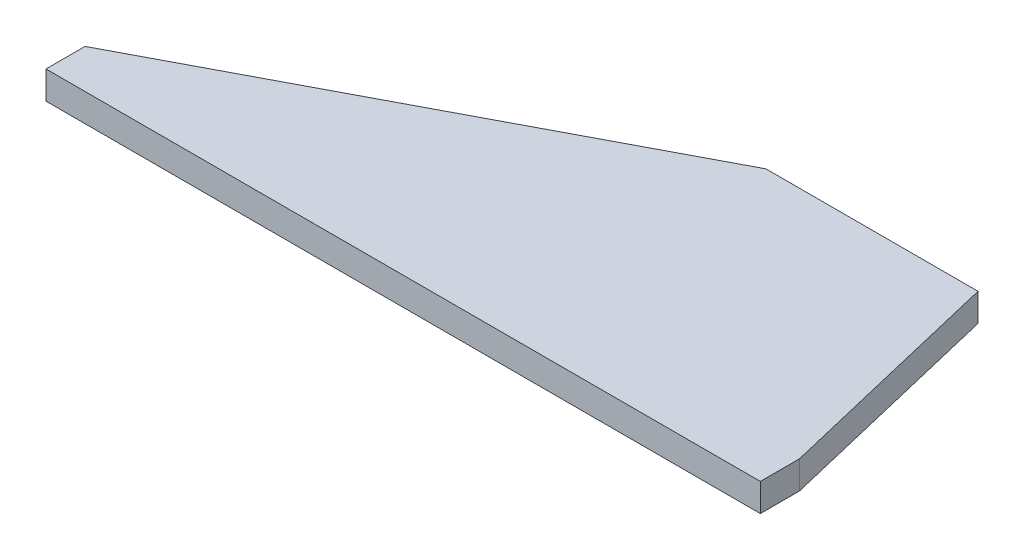
ISO-10303-21;
HEADER;
FILE_DESCRIPTION(('STEP AP214'),'2;1');
FILE_NAME('part.step','',(''),(''),'','','');
FILE_SCHEMA(('AUTOMOTIVE_DESIGN { 1 0 10303 214 1 1 1 1 }'));
ENDSEC;
DATA;
#1=APPLICATION_CONTEXT('core data for automotive mechanical design processes');
#2=APPLICATION_PROTOCOL_DEFINITION('international standard','automotive_design',2000,#1);
#3=PRODUCT_CONTEXT('',#1,'mechanical');
#4=PRODUCT('Part','Part','',(#3));
#5=PRODUCT_RELATED_PRODUCT_CATEGORY('part','',(#4));
#6=PRODUCT_DEFINITION_FORMATION('','',#4);
#7=PRODUCT_DEFINITION_CONTEXT('part definition',#1,'design');
#8=PRODUCT_DEFINITION('design','',#6,#7);
#9=PRODUCT_DEFINITION_SHAPE('','',#8);
#10=(LENGTH_UNIT() NAMED_UNIT(*) SI_UNIT(.MILLI.,.METRE.));
#11=(NAMED_UNIT(*) PLANE_ANGLE_UNIT() SI_UNIT($,.RADIAN.));
#12=(NAMED_UNIT(*) SI_UNIT($,.STERADIAN.) SOLID_ANGLE_UNIT());
#13=UNCERTAINTY_MEASURE_WITH_UNIT(LENGTH_MEASURE(1.E-05),#10,'distance_accuracy_value','');
#14=(GEOMETRIC_REPRESENTATION_CONTEXT(3) GLOBAL_UNCERTAINTY_ASSIGNED_CONTEXT((#13)) GLOBAL_UNIT_ASSIGNED_CONTEXT((#10,
#11,#12)) REPRESENTATION_CONTEXT('',''));
#15=CARTESIAN_POINT('',(0.,0.,0.));
#16=DIRECTION('',(0.,0.,1.));
#17=DIRECTION('',(1.,0.,0.));
#18=AXIS2_PLACEMENT_3D('',#15,#16,#17);
#19=CARTESIAN_POINT('',(0.,6.35,8.89));
#20=DIRECTION('',(1.,0.,0.));
#21=DIRECTION('',(0.,0.,-1.));
#22=AXIS2_PLACEMENT_3D('',#19,#20,#21);
#23=PLANE('',#22);
#24=DIRECTION('',(0.,0.,1.));
#25=VECTOR('',#24,1.);
#26=CARTESIAN_POINT('',(0.,0.,8.89));
#27=LINE('',#26,#25);
#28=CARTESIAN_POINT('',(0.,0.,0.));
#29=VERTEX_POINT('',#28);
#30=CARTESIAN_POINT('',(0.,0.,8.89));
#31=VERTEX_POINT('',#30);
#32=EDGE_CURVE('E123',#29,#31,#27,.T.);
#33=ORIENTED_EDGE('',*,*,#32,.T.);
#34=DIRECTION('',(0.,-1.,0.));
#35=VECTOR('',#34,1.);
#36=CARTESIAN_POINT('',(0.,6.35,8.89));
#37=LINE('',#36,#35);
#38=CARTESIAN_POINT('',(0.,6.35,8.89));
#39=VERTEX_POINT('',#38);
#40=EDGE_CURVE('E11',#39,#31,#37,.T.);
#41=ORIENTED_EDGE('',*,*,#40,.F.);
#42=DIRECTION('',(0.,0.,1.));
#43=VECTOR('',#42,1.);
#44=CARTESIAN_POINT('',(0.,6.35,8.89));
#45=LINE('',#44,#43);
#46=CARTESIAN_POINT('',(0.,6.35,0.));
#47=VERTEX_POINT('',#46);
#48=EDGE_CURVE('E133',#47,#39,#45,.T.);
#49=ORIENTED_EDGE('',*,*,#48,.F.);
#50=DIRECTION('',(0.,-1.,0.));
#51=VECTOR('',#50,1.);
#52=CARTESIAN_POINT('',(0.,6.35,0.));
#53=LINE('',#52,#51);
#54=EDGE_CURVE('E119',#47,#29,#53,.T.);
#55=ORIENTED_EDGE('',*,*,#54,.T.);
#56=EDGE_LOOP('',(#33,#41,#49,#55));
#57=FACE_BOUND('',#56,.T.);
#58=ADVANCED_FACE('F39',(#57),#23,.F.);
#59=CARTESIAN_POINT('',(0.,6.35,8.89));
#60=DIRECTION('',(0.,0.,-1.));
#61=DIRECTION('',(-1.,0.,0.));
#62=AXIS2_PLACEMENT_3D('',#59,#60,#61);
#63=PLANE('',#62);
#64=DIRECTION('',(1.,0.,0.));
#65=VECTOR('',#64,1.);
#66=CARTESIAN_POINT('',(0.,0.,8.89));
#67=LINE('',#66,#65);
#68=CARTESIAN_POINT('',(162.56,0.,8.89));
#69=VERTEX_POINT('',#68);
#70=EDGE_CURVE('E126',#31,#69,#67,.T.);
#71=ORIENTED_EDGE('',*,*,#70,.T.);
#72=DIRECTION('',(0.,-1.,0.));
#73=VECTOR('',#72,1.);
#74=CARTESIAN_POINT('',(162.56,6.35,8.89));
#75=LINE('',#74,#73);
#76=CARTESIAN_POINT('',(162.56,6.35,8.89));
#77=VERTEX_POINT('',#76);
#78=EDGE_CURVE('E47',#77,#69,#75,.T.);
#79=ORIENTED_EDGE('',*,*,#78,.F.);
#80=DIRECTION('',(1.,0.,0.));
#81=VECTOR('',#80,1.);
#82=CARTESIAN_POINT('',(0.,6.35,8.89));
#83=LINE('',#82,#81);
#84=EDGE_CURVE('E92',#39,#77,#83,.T.);
#85=ORIENTED_EDGE('',*,*,#84,.F.);
#86=ORIENTED_EDGE('',*,*,#40,.T.);
#87=EDGE_LOOP('',(#71,#79,#85,#86));
#88=FACE_BOUND('',#87,.T.);
#89=ADVANCED_FACE('F157',(#88),#63,.F.);
#90=CARTESIAN_POINT('',(162.56,6.35,8.89));
#91=DIRECTION('',(-1.,0.,0.));
#92=DIRECTION('',(0.,0.,1.));
#93=AXIS2_PLACEMENT_3D('',#90,#91,#92);
#94=PLANE('',#93);
#95=DIRECTION('',(0.,0.,-1.));
#96=VECTOR('',#95,1.);
#97=CARTESIAN_POINT('',(162.56,0.,8.89));
#98=LINE('',#97,#96);
#99=CARTESIAN_POINT('',(162.56,0.,0.));
#100=VERTEX_POINT('',#99);
#101=EDGE_CURVE('E128',#69,#100,#98,.T.);
#102=ORIENTED_EDGE('',*,*,#101,.T.);
#103=DIRECTION('',(0.,-1.,0.));
#104=VECTOR('',#103,1.);
#105=CARTESIAN_POINT('',(162.56,6.35,0.));
#106=LINE('',#105,#104);
#107=CARTESIAN_POINT('',(162.56,6.35,0.));
#108=VERTEX_POINT('',#107);
#109=EDGE_CURVE('E114',#108,#100,#106,.T.);
#110=ORIENTED_EDGE('',*,*,#109,.F.);
#111=DIRECTION('',(0.,0.,-1.));
#112=VECTOR('',#111,1.);
#113=CARTESIAN_POINT('',(162.56,6.35,8.89));
#114=LINE('',#113,#112);
#115=EDGE_CURVE('E105',#77,#108,#114,.T.);
#116=ORIENTED_EDGE('',*,*,#115,.F.);
#117=ORIENTED_EDGE('',*,*,#78,.T.);
#118=EDGE_LOOP('',(#102,#110,#116,#117));
#119=FACE_BOUND('',#118,.T.);
#120=ADVANCED_FACE('F139',(#119),#94,.F.);
#121=CARTESIAN_POINT('',(149.86,6.35,-53.34));
#122=DIRECTION('',(-0.972806214685367,0.,0.23162052730604));
#123=DIRECTION('',(0.23162052730604,0.,0.972806214685367));
#124=AXIS2_PLACEMENT_3D('',#121,#122,#123);
#125=PLANE('',#124);
#126=DIRECTION('',(-0.23162052730604,0.,-0.972806214685367));
#127=VECTOR('',#126,1.);
#128=CARTESIAN_POINT('',(149.86,0.,-53.34));
#129=LINE('',#128,#127);
#130=CARTESIAN_POINT('',(149.86,0.,-53.34));
#131=VERTEX_POINT('',#130);
#132=EDGE_CURVE('E113',#100,#131,#129,.T.);
#133=ORIENTED_EDGE('',*,*,#132,.T.);
#134=DIRECTION('',(0.,-1.,0.));
#135=VECTOR('',#134,1.);
#136=CARTESIAN_POINT('',(149.86,6.35,-53.34));
#137=LINE('',#136,#135);
#138=CARTESIAN_POINT('',(149.86,6.35,-53.34));
#139=VERTEX_POINT('',#138);
#140=EDGE_CURVE('E110',#139,#131,#137,.T.);
#141=ORIENTED_EDGE('',*,*,#140,.F.);
#142=DIRECTION('',(-0.23162052730604,0.,-0.972806214685367));
#143=VECTOR('',#142,1.);
#144=CARTESIAN_POINT('',(149.86,6.35,-53.34));
#145=LINE('',#144,#143);
#146=EDGE_CURVE('E99',#108,#139,#145,.T.);
#147=ORIENTED_EDGE('',*,*,#146,.F.);
#148=ORIENTED_EDGE('',*,*,#109,.T.);
#149=EDGE_LOOP('',(#133,#141,#147,#148));
#150=FACE_BOUND('',#149,.T.);
#151=ADVANCED_FACE('F111',(#150),#125,.F.);
#152=CARTESIAN_POINT('',(101.6,6.35,-53.34));
#153=DIRECTION('',(0.,0.,1.));
#154=DIRECTION('',(1.,0.,0.));
#155=AXIS2_PLACEMENT_3D('',#152,#153,#154);
#156=PLANE('',#155);
#157=DIRECTION('',(-1.,0.,0.));
#158=VECTOR('',#157,1.);
#159=CARTESIAN_POINT('',(101.6,0.,-53.34));
#160=LINE('',#159,#158);
#161=CARTESIAN_POINT('',(101.6,0.,-53.34));
#162=VERTEX_POINT('',#161);
#163=EDGE_CURVE('E78',#131,#162,#160,.T.);
#164=ORIENTED_EDGE('',*,*,#163,.T.);
#165=DIRECTION('',(0.,-1.,0.));
#166=VECTOR('',#165,1.);
#167=CARTESIAN_POINT('',(101.6,6.35,-53.34));
#168=LINE('',#167,#166);
#169=CARTESIAN_POINT('',(101.6,6.35,-53.34));
#170=VERTEX_POINT('',#169);
#171=EDGE_CURVE('E115',#170,#162,#168,.T.);
#172=ORIENTED_EDGE('',*,*,#171,.F.);
#173=DIRECTION('',(-1.,0.,0.));
#174=VECTOR('',#173,1.);
#175=CARTESIAN_POINT('',(101.6,6.35,-53.34));
#176=LINE('',#175,#174);
#177=EDGE_CURVE('E103',#139,#170,#176,.T.);
#178=ORIENTED_EDGE('',*,*,#177,.F.);
#179=ORIENTED_EDGE('',*,*,#140,.T.);
#180=EDGE_LOOP('',(#164,#172,#178,#179));
#181=FACE_BOUND('',#180,.T.);
#182=ADVANCED_FACE('F117',(#181),#156,.F.);
#183=CARTESIAN_POINT('',(0.,6.35,0.));
#184=DIRECTION('',(0.46483389898992,0.,0.885397902837944));
#185=DIRECTION('',(0.885397902837944,0.,-0.46483389898992));
#186=AXIS2_PLACEMENT_3D('',#183,#184,#185);
#187=PLANE('',#186);
#188=DIRECTION('',(-0.885397902837944,0.,0.46483389898992));
#189=VECTOR('',#188,1.);
#190=CARTESIAN_POINT('',(0.,0.,0.));
#191=LINE('',#190,#189);
#192=EDGE_CURVE('E84',#162,#29,#191,.T.);
#193=ORIENTED_EDGE('',*,*,#192,.T.);
#194=ORIENTED_EDGE('',*,*,#54,.F.);
#195=DIRECTION('',(-0.885397902837944,0.,0.46483389898992));
#196=VECTOR('',#195,1.);
#197=CARTESIAN_POINT('',(0.,6.35,0.));
#198=LINE('',#197,#196);
#199=EDGE_CURVE('E55',#170,#47,#198,.T.);
#200=ORIENTED_EDGE('',*,*,#199,.F.);
#201=ORIENTED_EDGE('',*,*,#171,.T.);
#202=EDGE_LOOP('',(#193,#194,#200,#201));
#203=FACE_BOUND('',#202,.T.);
#204=ADVANCED_FACE('F146',(#203),#187,.F.);
#205=CARTESIAN_POINT('',(0.,6.35,0.));
#206=DIRECTION('',(0.,-1.,0.));
#207=DIRECTION('',(0.,0.,-1.));
#208=AXIS2_PLACEMENT_3D('',#205,#206,#207);
#209=PLANE('',#208);
#210=ORIENTED_EDGE('',*,*,#48,.T.);
#211=ORIENTED_EDGE('',*,*,#84,.T.);
#212=ORIENTED_EDGE('',*,*,#115,.T.);
#213=ORIENTED_EDGE('',*,*,#146,.T.);
#214=ORIENTED_EDGE('',*,*,#177,.T.);
#215=ORIENTED_EDGE('',*,*,#199,.T.);
#216=EDGE_LOOP('',(#210,#211,#212,#213,#214,#215));
#217=FACE_BOUND('',#216,.T.);
#218=ADVANCED_FACE('F101',(#217),#209,.F.);
#219=CARTESIAN_POINT('',(0.,0.,0.));
#220=DIRECTION('',(0.,-1.,0.));
#221=DIRECTION('',(0.,0.,-1.));
#222=AXIS2_PLACEMENT_3D('',#219,#220,#221);
#223=PLANE('',#222);
#224=ORIENTED_EDGE('',*,*,#32,.F.);
#225=ORIENTED_EDGE('',*,*,#192,.F.);
#226=ORIENTED_EDGE('',*,*,#163,.F.);
#227=ORIENTED_EDGE('',*,*,#132,.F.);
#228=ORIENTED_EDGE('',*,*,#101,.F.);
#229=ORIENTED_EDGE('',*,*,#70,.F.);
#230=EDGE_LOOP('',(#224,#225,#226,#227,#228,#229));
#231=FACE_BOUND('',#230,.T.);
#232=ADVANCED_FACE('F142',(#231),#223,.T.);
#233=CLOSED_SHELL('',(#58,#89,#120,#151,#182,#204,#218,#232));
#234=MANIFOLD_SOLID_BREP('B2',#233);
#235=ADVANCED_BREP_SHAPE_REPRESENTATION('',(#18,#234),#14);
#236=SHAPE_DEFINITION_REPRESENTATION(#9,#235);
ENDSEC;
END-ISO-10303-21;
